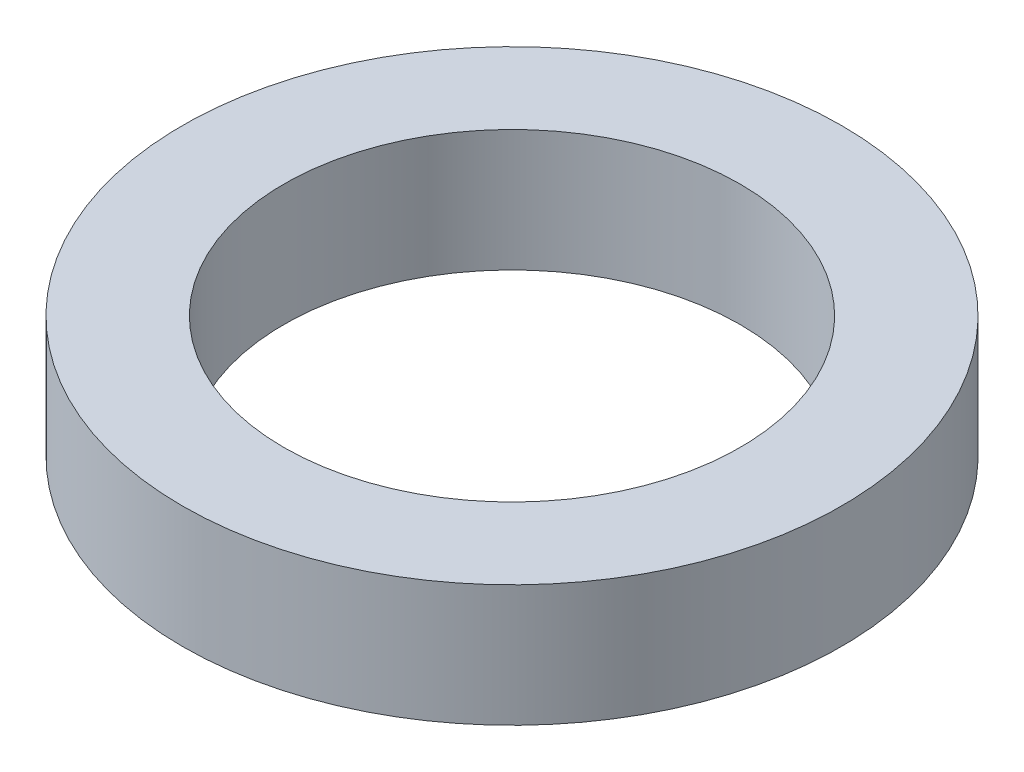
ISO-10303-21;
HEADER;
FILE_DESCRIPTION(('STEP AP214'),'2;1');
FILE_NAME('part.step','',(''),(''),'','','');
FILE_SCHEMA(('AUTOMOTIVE_DESIGN { 1 0 10303 214 1 1 1 1 }'));
ENDSEC;
DATA;
#1=APPLICATION_CONTEXT('core data for automotive mechanical design processes');
#2=APPLICATION_PROTOCOL_DEFINITION('international standard','automotive_design',2000,#1);
#3=PRODUCT_CONTEXT('',#1,'mechanical');
#4=PRODUCT('Part','Part','',(#3));
#5=PRODUCT_RELATED_PRODUCT_CATEGORY('part','',(#4));
#6=PRODUCT_DEFINITION_FORMATION('','',#4);
#7=PRODUCT_DEFINITION_CONTEXT('part definition',#1,'design');
#8=PRODUCT_DEFINITION('design','',#6,#7);
#9=PRODUCT_DEFINITION_SHAPE('','',#8);
#10=(LENGTH_UNIT() NAMED_UNIT(*) SI_UNIT(.MILLI.,.METRE.));
#11=(NAMED_UNIT(*) PLANE_ANGLE_UNIT() SI_UNIT($,.RADIAN.));
#12=(NAMED_UNIT(*) SI_UNIT($,.STERADIAN.) SOLID_ANGLE_UNIT());
#13=UNCERTAINTY_MEASURE_WITH_UNIT(LENGTH_MEASURE(1.E-05),#10,'distance_accuracy_value','');
#14=(GEOMETRIC_REPRESENTATION_CONTEXT(3) GLOBAL_UNCERTAINTY_ASSIGNED_CONTEXT((#13)) GLOBAL_UNIT_ASSIGNED_CONTEXT((#10,
#11,#12)) REPRESENTATION_CONTEXT('',''));
#15=CARTESIAN_POINT('',(0.,0.,0.));
#16=DIRECTION('',(0.,0.,1.));
#17=DIRECTION('',(1.,0.,0.));
#18=AXIS2_PLACEMENT_3D('',#15,#16,#17);
#19=CARTESIAN_POINT('',(0.,12.,0.));
#20=DIRECTION('',(0.,-1.,0.));
#21=DIRECTION('',(0.,0.,-1.));
#22=AXIS2_PLACEMENT_3D('',#19,#20,#21);
#23=CYLINDRICAL_SURFACE('',#22,32.5);
#24=CARTESIAN_POINT('',(0.,12.,0.));
#25=DIRECTION('',(0.,1.,0.));
#26=DIRECTION('',(0.,0.,1.));
#27=AXIS2_PLACEMENT_3D('',#24,#25,#26);
#28=CIRCLE('',#27,32.5);
#29=CARTESIAN_POINT('',(0.,12.,32.5));
#30=VERTEX_POINT('',#29);
#31=EDGE_CURVE('E10',#30,#30,#28,.T.);
#32=ORIENTED_EDGE('',*,*,#31,.F.);
#33=EDGE_LOOP('',(#32));
#34=FACE_BOUND('',#33,.T.);
#35=CARTESIAN_POINT('',(0.,0.,0.));
#36=DIRECTION('',(0.,1.,0.));
#37=DIRECTION('',(0.,0.,1.));
#38=AXIS2_PLACEMENT_3D('',#35,#36,#37);
#39=CIRCLE('',#38,32.5);
#40=CARTESIAN_POINT('',(0.,0.,32.5));
#41=VERTEX_POINT('',#40);
#42=EDGE_CURVE('E37',#41,#41,#39,.T.);
#43=ORIENTED_EDGE('',*,*,#42,.T.);
#44=EDGE_LOOP('',(#43));
#45=FACE_BOUND('',#44,.T.);
#46=ADVANCED_FACE('F40',(#34,#45),#23,.T.);
#47=CARTESIAN_POINT('',(0.,12.,0.));
#48=DIRECTION('',(0.,1.,0.));
#49=DIRECTION('',(0.,0.,1.));
#50=AXIS2_PLACEMENT_3D('',#47,#48,#49);
#51=PLANE('',#50);
#52=CARTESIAN_POINT('',(0.,12.,0.));
#53=DIRECTION('',(0.,1.,0.));
#54=DIRECTION('',(0.,0.,1.));
#55=AXIS2_PLACEMENT_3D('',#52,#53,#54);
#56=CIRCLE('',#55,22.5);
#57=CARTESIAN_POINT('',(0.,12.,22.5));
#58=VERTEX_POINT('',#57);
#59=EDGE_CURVE('E50',#58,#58,#56,.T.);
#60=ORIENTED_EDGE('',*,*,#59,.F.);
#61=EDGE_LOOP('',(#60));
#62=FACE_BOUND('',#61,.T.);
#63=ORIENTED_EDGE('',*,*,#31,.T.);
#64=EDGE_LOOP('',(#63));
#65=FACE_BOUND('',#64,.T.);
#66=ADVANCED_FACE('F59',(#62,#65),#51,.T.);
#67=CARTESIAN_POINT('',(0.,0.,0.));
#68=DIRECTION('',(0.,1.,0.));
#69=DIRECTION('',(0.,0.,1.));
#70=AXIS2_PLACEMENT_3D('',#67,#68,#69);
#71=PLANE('',#70);
#72=CARTESIAN_POINT('',(0.,0.,0.));
#73=DIRECTION('',(0.,1.,0.));
#74=DIRECTION('',(0.,0.,1.));
#75=AXIS2_PLACEMENT_3D('',#72,#73,#74);
#76=CIRCLE('',#75,22.5);
#77=CARTESIAN_POINT('',(0.,0.,22.5));
#78=VERTEX_POINT('',#77);
#79=EDGE_CURVE('E47',#78,#78,#76,.T.);
#80=ORIENTED_EDGE('',*,*,#79,.T.);
#81=EDGE_LOOP('',(#80));
#82=FACE_BOUND('',#81,.T.);
#83=ORIENTED_EDGE('',*,*,#42,.F.);
#84=EDGE_LOOP('',(#83));
#85=FACE_BOUND('',#84,.T.);
#86=ADVANCED_FACE('F58',(#82,#85),#71,.F.);
#87=CARTESIAN_POINT('',(0.,12.,0.));
#88=DIRECTION('',(0.,-1.,0.));
#89=DIRECTION('',(0.,0.,-1.));
#90=AXIS2_PLACEMENT_3D('',#87,#88,#89);
#91=CYLINDRICAL_SURFACE('',#90,22.5);
#92=ORIENTED_EDGE('',*,*,#59,.T.);
#93=EDGE_LOOP('',(#92));
#94=FACE_BOUND('',#93,.T.);
#95=ORIENTED_EDGE('',*,*,#79,.F.);
#96=EDGE_LOOP('',(#95));
#97=FACE_BOUND('',#96,.T.);
#98=ADVANCED_FACE('F54',(#94,#97),#91,.F.);
#99=CLOSED_SHELL('',(#46,#66,#86,#98));
#100=MANIFOLD_SOLID_BREP('B2',#99);
#101=ADVANCED_BREP_SHAPE_REPRESENTATION('',(#18,#100),#14);
#102=SHAPE_DEFINITION_REPRESENTATION(#9,#101);
ENDSEC;
END-ISO-10303-21;
